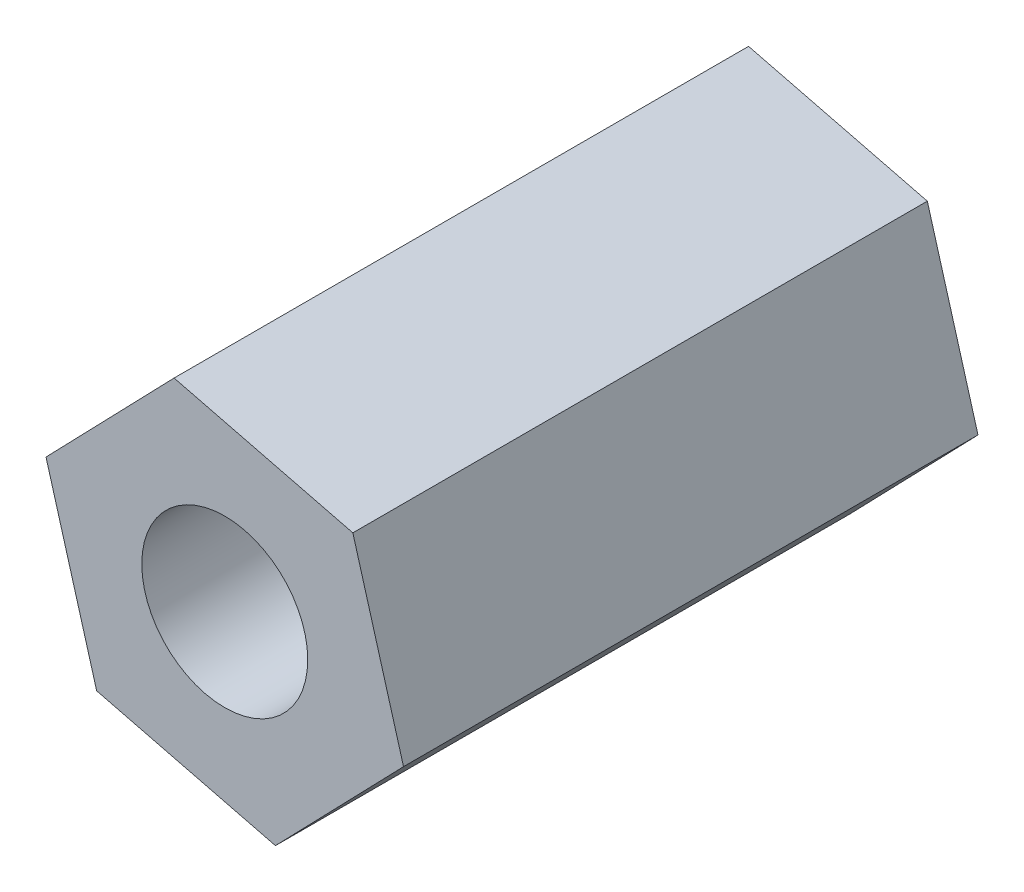
ISO-10303-21;
HEADER;
FILE_DESCRIPTION(('STEP AP214'),'2;1');
FILE_NAME('part.step','',(''),(''),'','','');
FILE_SCHEMA(('AUTOMOTIVE_DESIGN { 1 0 10303 214 1 1 1 1 }'));
ENDSEC;
DATA;
#1=APPLICATION_CONTEXT('core data for automotive mechanical design processes');
#2=APPLICATION_PROTOCOL_DEFINITION('international standard','automotive_design',2000,#1);
#3=PRODUCT_CONTEXT('',#1,'mechanical');
#4=PRODUCT('Part','Part','',(#3));
#5=PRODUCT_RELATED_PRODUCT_CATEGORY('part','',(#4));
#6=PRODUCT_DEFINITION_FORMATION('','',#4);
#7=PRODUCT_DEFINITION_CONTEXT('part definition',#1,'design');
#8=PRODUCT_DEFINITION('design','',#6,#7);
#9=PRODUCT_DEFINITION_SHAPE('','',#8);
#10=(LENGTH_UNIT() NAMED_UNIT(*) SI_UNIT(.MILLI.,.METRE.));
#11=(NAMED_UNIT(*) PLANE_ANGLE_UNIT() SI_UNIT($,.RADIAN.));
#12=(NAMED_UNIT(*) SI_UNIT($,.STERADIAN.) SOLID_ANGLE_UNIT());
#13=UNCERTAINTY_MEASURE_WITH_UNIT(LENGTH_MEASURE(1.E-05),#10,'distance_accuracy_value','');
#14=(GEOMETRIC_REPRESENTATION_CONTEXT(3) GLOBAL_UNCERTAINTY_ASSIGNED_CONTEXT((#13)) GLOBAL_UNIT_ASSIGNED_CONTEXT((#10,
#11,#12)) REPRESENTATION_CONTEXT('',''));
#15=CARTESIAN_POINT('',(0.,0.,0.));
#16=DIRECTION('',(0.,0.,1.));
#17=DIRECTION('',(1.,0.,0.));
#18=AXIS2_PLACEMENT_3D('',#15,#16,#17);
#19=CARTESIAN_POINT('',(-2.01661019445048,7.04958272928063,22.86));
#20=DIRECTION('',(0.718900237898645,-0.695113262676862,0.));
#21=DIRECTION('',(0.695113262676862,0.718900237898645,0.));
#22=AXIS2_PLACEMENT_3D('',#19,#20,#21);
#23=PLANE('',#22);
#24=DIRECTION('',(-0.695113262676862,-0.718900237898645,0.));
#25=VECTOR('',#24,1.);
#26=CARTESIAN_POINT('',(-2.01661019445048,7.04958272928063,0.));
#27=LINE('',#26,#25);
#28=CARTESIAN_POINT('',(-2.01661019445048,7.04958272928063,0.));
#29=VERTEX_POINT('',#28);
#30=CARTESIAN_POINT('',(-7.1134228268623,1.77835570671552,0.));
#31=VERTEX_POINT('',#30);
#32=EDGE_CURVE('E128',#29,#31,#27,.T.);
#33=ORIENTED_EDGE('',*,*,#32,.T.);
#34=DIRECTION('',(0.,0.,-1.));
#35=VECTOR('',#34,1.);
#36=CARTESIAN_POINT('',(-7.1134228268623,1.77835570671552,22.86));
#37=LINE('',#36,#35);
#38=CARTESIAN_POINT('',(-7.1134228268623,1.77835570671552,22.86));
#39=VERTEX_POINT('',#38);
#40=EDGE_CURVE('E11',#39,#31,#37,.T.);
#41=ORIENTED_EDGE('',*,*,#40,.F.);
#42=DIRECTION('',(-0.695113262676862,-0.718900237898645,0.));
#43=VECTOR('',#42,1.);
#44=CARTESIAN_POINT('',(-2.01661019445048,7.04958272928063,22.86));
#45=LINE('',#44,#43);
#46=CARTESIAN_POINT('',(-2.01661019445048,7.04958272928063,22.86));
#47=VERTEX_POINT('',#46);
#48=EDGE_CURVE('E145',#47,#39,#45,.T.);
#49=ORIENTED_EDGE('',*,*,#48,.F.);
#50=DIRECTION('',(0.,0.,-1.));
#51=VECTOR('',#50,1.);
#52=CARTESIAN_POINT('',(-2.01661019445048,7.04958272928063,22.86));
#53=LINE('',#52,#51);
#54=EDGE_CURVE('E124',#47,#29,#53,.T.);
#55=ORIENTED_EDGE('',*,*,#54,.T.);
#56=EDGE_LOOP('',(#33,#41,#49,#55));
#57=FACE_BOUND('',#56,.T.);
#58=ADVANCED_FACE('F39',(#57),#23,.F.);
#59=CARTESIAN_POINT('',(-7.1134228268623,1.77835570671552,22.86));
#60=DIRECTION('',(0.96143586293497,0.275029237468472,0.));
#61=DIRECTION('',(-0.275029237468472,0.96143586293497,0.));
#62=AXIS2_PLACEMENT_3D('',#59,#60,#61);
#63=PLANE('',#62);
#64=DIRECTION('',(0.275029237468472,-0.96143586293497,0.));
#65=VECTOR('',#64,1.);
#66=CARTESIAN_POINT('',(-7.1134228268623,1.77835570671552,0.));
#67=LINE('',#66,#65);
#68=CARTESIAN_POINT('',(-5.09681263241182,-5.27122702256511,0.));
#69=VERTEX_POINT('',#68);
#70=EDGE_CURVE('E132',#31,#69,#67,.T.);
#71=ORIENTED_EDGE('',*,*,#70,.T.);
#72=DIRECTION('',(0.,0.,-1.));
#73=VECTOR('',#72,1.);
#74=CARTESIAN_POINT('',(-5.09681263241182,-5.27122702256511,22.86));
#75=LINE('',#74,#73);
#76=CARTESIAN_POINT('',(-5.09681263241182,-5.27122702256511,22.86));
#77=VERTEX_POINT('',#76);
#78=EDGE_CURVE('E48',#77,#69,#75,.T.);
#79=ORIENTED_EDGE('',*,*,#78,.F.);
#80=DIRECTION('',(0.275029237468472,-0.96143586293497,0.));
#81=VECTOR('',#80,1.);
#82=CARTESIAN_POINT('',(-7.1134228268623,1.77835570671552,22.86));
#83=LINE('',#82,#81);
#84=EDGE_CURVE('E93',#39,#77,#83,.T.);
#85=ORIENTED_EDGE('',*,*,#84,.F.);
#86=ORIENTED_EDGE('',*,*,#40,.T.);
#87=EDGE_LOOP('',(#71,#79,#85,#86));
#88=FACE_BOUND('',#87,.T.);
#89=ADVANCED_FACE('F174',(#88),#63,.F.);
#90=CARTESIAN_POINT('',(-5.09681263241182,-5.27122702256511,22.86));
#91=DIRECTION('',(0.242535625036325,0.970142500145334,0.));
#92=DIRECTION('',(-0.970142500145334,0.242535625036325,0.));
#93=AXIS2_PLACEMENT_3D('',#90,#91,#92);
#94=PLANE('',#93);
#95=DIRECTION('',(0.970142500145334,-0.242535625036325,0.));
#96=VECTOR('',#95,1.);
#97=CARTESIAN_POINT('',(-5.09681263241182,-5.27122702256511,0.));
#98=LINE('',#97,#96);
#99=CARTESIAN_POINT('',(2.01661019445049,-7.04958272928063,0.));
#100=VERTEX_POINT('',#99);
#101=EDGE_CURVE('E136',#69,#100,#98,.T.);
#102=ORIENTED_EDGE('',*,*,#101,.T.);
#103=DIRECTION('',(0.,0.,-1.));
#104=VECTOR('',#103,1.);
#105=CARTESIAN_POINT('',(2.01661019445049,-7.04958272928063,22.86));
#106=LINE('',#105,#104);
#107=CARTESIAN_POINT('',(2.01661019445049,-7.04958272928063,22.86));
#108=VERTEX_POINT('',#107);
#109=EDGE_CURVE('E117',#108,#100,#106,.T.);
#110=ORIENTED_EDGE('',*,*,#109,.F.);
#111=DIRECTION('',(0.970142500145334,-0.242535625036325,0.));
#112=VECTOR('',#111,1.);
#113=CARTESIAN_POINT('',(-5.09681263241182,-5.27122702256511,22.86));
#114=LINE('',#113,#112);
#115=EDGE_CURVE('E106',#77,#108,#114,.T.);
#116=ORIENTED_EDGE('',*,*,#115,.F.);
#117=ORIENTED_EDGE('',*,*,#78,.T.);
#118=EDGE_LOOP('',(#102,#110,#116,#117));
#119=FACE_BOUND('',#118,.T.);
#120=ADVANCED_FACE('F155',(#119),#94,.F.);
#121=CARTESIAN_POINT('',(2.01661019445049,-7.04958272928063,22.86));
#122=DIRECTION('',(-0.718900237898645,0.695113262676862,0.));
#123=DIRECTION('',(-0.695113262676862,-0.718900237898645,0.));
#124=AXIS2_PLACEMENT_3D('',#121,#122,#123);
#125=PLANE('',#124);
#126=DIRECTION('',(0.695113262676862,0.718900237898645,0.));
#127=VECTOR('',#126,1.);
#128=CARTESIAN_POINT('',(2.01661019445049,-7.04958272928063,0.));
#129=LINE('',#128,#127);
#130=CARTESIAN_POINT('',(7.1134228268623,-1.77835570671552,0.));
#131=VERTEX_POINT('',#130);
#132=EDGE_CURVE('E115',#100,#131,#129,.T.);
#133=ORIENTED_EDGE('',*,*,#132,.T.);
#134=DIRECTION('',(0.,0.,-1.));
#135=VECTOR('',#134,1.);
#136=CARTESIAN_POINT('',(7.1134228268623,-1.77835570671552,22.86));
#137=LINE('',#136,#135);
#138=CARTESIAN_POINT('',(7.1134228268623,-1.77835570671552,22.86));
#139=VERTEX_POINT('',#138);
#140=EDGE_CURVE('E112',#139,#131,#137,.T.);
#141=ORIENTED_EDGE('',*,*,#140,.F.);
#142=DIRECTION('',(0.695113262676862,0.718900237898645,0.));
#143=VECTOR('',#142,1.);
#144=CARTESIAN_POINT('',(2.01661019445049,-7.04958272928063,22.86));
#145=LINE('',#144,#143);
#146=EDGE_CURVE('E100',#108,#139,#145,.T.);
#147=ORIENTED_EDGE('',*,*,#146,.F.);
#148=ORIENTED_EDGE('',*,*,#109,.T.);
#149=EDGE_LOOP('',(#133,#141,#147,#148));
#150=FACE_BOUND('',#149,.T.);
#151=ADVANCED_FACE('F113',(#150),#125,.F.);
#152=CARTESIAN_POINT('',(7.1134228268623,-1.77835570671552,22.86));
#153=DIRECTION('',(-0.96143586293497,-0.275029237468472,0.));
#154=DIRECTION('',(0.275029237468472,-0.96143586293497,0.));
#155=AXIS2_PLACEMENT_3D('',#152,#153,#154);
#156=PLANE('',#155);
#157=DIRECTION('',(-0.275029237468472,0.96143586293497,0.));
#158=VECTOR('',#157,1.);
#159=CARTESIAN_POINT('',(7.1134228268623,-1.77835570671552,0.));
#160=LINE('',#159,#158);
#161=CARTESIAN_POINT('',(5.09681263241182,5.27122702256512,0.));
#162=VERTEX_POINT('',#161);
#163=EDGE_CURVE('E79',#131,#162,#160,.T.);
#164=ORIENTED_EDGE('',*,*,#163,.T.);
#165=DIRECTION('',(0.,0.,-1.));
#166=VECTOR('',#165,1.);
#167=CARTESIAN_POINT('',(5.09681263241182,5.27122702256512,22.86));
#168=LINE('',#167,#166);
#169=CARTESIAN_POINT('',(5.09681263241182,5.27122702256512,22.86));
#170=VERTEX_POINT('',#169);
#171=EDGE_CURVE('E118',#170,#162,#168,.T.);
#172=ORIENTED_EDGE('',*,*,#171,.F.);
#173=DIRECTION('',(-0.275029237468472,0.96143586293497,0.));
#174=VECTOR('',#173,1.);
#175=CARTESIAN_POINT('',(7.1134228268623,-1.77835570671552,22.86));
#176=LINE('',#175,#174);
#177=EDGE_CURVE('E104',#139,#170,#176,.T.);
#178=ORIENTED_EDGE('',*,*,#177,.F.);
#179=ORIENTED_EDGE('',*,*,#140,.T.);
#180=EDGE_LOOP('',(#164,#172,#178,#179));
#181=FACE_BOUND('',#180,.T.);
#182=ADVANCED_FACE('F120',(#181),#156,.F.);
#183=CARTESIAN_POINT('',(5.09681263241182,5.27122702256512,22.86));
#184=DIRECTION('',(-0.242535625036325,-0.970142500145334,0.));
#185=DIRECTION('',(0.970142500145334,-0.242535625036325,0.));
#186=AXIS2_PLACEMENT_3D('',#183,#184,#185);
#187=PLANE('',#186);
#188=DIRECTION('',(-0.970142500145334,0.242535625036325,0.));
#189=VECTOR('',#188,1.);
#190=CARTESIAN_POINT('',(5.09681263241182,5.27122702256512,0.));
#191=LINE('',#190,#189);
#192=EDGE_CURVE('E85',#162,#29,#191,.T.);
#193=ORIENTED_EDGE('',*,*,#192,.T.);
#194=ORIENTED_EDGE('',*,*,#54,.F.);
#195=DIRECTION('',(-0.970142500145334,0.242535625036325,0.));
#196=VECTOR('',#195,1.);
#197=CARTESIAN_POINT('',(5.09681263241182,5.27122702256512,22.86));
#198=LINE('',#197,#196);
#199=EDGE_CURVE('E56',#170,#47,#198,.T.);
#200=ORIENTED_EDGE('',*,*,#199,.F.);
#201=ORIENTED_EDGE('',*,*,#171,.T.);
#202=EDGE_LOOP('',(#193,#194,#200,#201));
#203=FACE_BOUND('',#202,.T.);
#204=ADVANCED_FACE('F162',(#203),#187,.F.);
#205=CARTESIAN_POINT('',(0.,0.,22.86));
#206=DIRECTION('',(0.,0.,1.));
#207=DIRECTION('',(1.,0.,0.));
#208=AXIS2_PLACEMENT_3D('',#205,#206,#207);
#209=PLANE('',#208);
#210=CARTESIAN_POINT('',(0.,0.,22.86));
#211=DIRECTION('',(0.,0.,1.));
#212=DIRECTION('',(1.,0.,0.));
#213=AXIS2_PLACEMENT_3D('',#210,#211,#212);
#214=CIRCLE('',#213,3.302);
#215=CARTESIAN_POINT('',(3.302,0.,22.86));
#216=VERTEX_POINT('',#215);
#217=EDGE_CURVE('E133',#216,#216,#214,.T.);
#218=ORIENTED_EDGE('',*,*,#217,.F.);
#219=EDGE_LOOP('',(#218));
#220=FACE_BOUND('',#219,.T.);
#221=ORIENTED_EDGE('',*,*,#48,.T.);
#222=ORIENTED_EDGE('',*,*,#84,.T.);
#223=ORIENTED_EDGE('',*,*,#115,.T.);
#224=ORIENTED_EDGE('',*,*,#146,.T.);
#225=ORIENTED_EDGE('',*,*,#177,.T.);
#226=ORIENTED_EDGE('',*,*,#199,.T.);
#227=EDGE_LOOP('',(#221,#222,#223,#224,#225,#226));
#228=FACE_BOUND('',#227,.T.);
#229=ADVANCED_FACE('F102',(#220,#228),#209,.T.);
#230=CARTESIAN_POINT('',(0.,0.,0.));
#231=DIRECTION('',(0.,0.,1.));
#232=DIRECTION('',(1.,0.,0.));
#233=AXIS2_PLACEMENT_3D('',#230,#231,#232);
#234=PLANE('',#233);
#235=CARTESIAN_POINT('',(0.,0.,0.));
#236=DIRECTION('',(0.,0.,-1.));
#237=DIRECTION('',(-1.,0.,0.));
#238=AXIS2_PLACEMENT_3D('',#235,#236,#237);
#239=CIRCLE('',#238,3.302);
#240=CARTESIAN_POINT('',(-3.302,0.,0.));
#241=VERTEX_POINT('',#240);
#242=EDGE_CURVE('E229',#241,#241,#239,.T.);
#243=ORIENTED_EDGE('',*,*,#242,.F.);
#244=EDGE_LOOP('',(#243));
#245=FACE_BOUND('',#244,.T.);
#246=ORIENTED_EDGE('',*,*,#32,.F.);
#247=ORIENTED_EDGE('',*,*,#192,.F.);
#248=ORIENTED_EDGE('',*,*,#163,.F.);
#249=ORIENTED_EDGE('',*,*,#132,.F.);
#250=ORIENTED_EDGE('',*,*,#101,.F.);
#251=ORIENTED_EDGE('',*,*,#70,.F.);
#252=EDGE_LOOP('',(#246,#247,#248,#249,#250,#251));
#253=FACE_BOUND('',#252,.T.);
#254=ADVANCED_FACE('F158',(#245,#253),#234,.F.);
#255=CARTESIAN_POINT('',(0.,0.,39.878));
#256=DIRECTION('',(0.,0.,-1.));
#257=DIRECTION('',(-1.,0.,0.));
#258=AXIS2_PLACEMENT_3D('',#255,#256,#257);
#259=CYLINDRICAL_SURFACE('',#258,3.302);
#260=ORIENTED_EDGE('',*,*,#217,.T.);
#261=EDGE_LOOP('',(#260));
#262=FACE_BOUND('',#261,.T.);
#263=ORIENTED_EDGE('',*,*,#242,.T.);
#264=EDGE_LOOP('',(#263));
#265=FACE_BOUND('',#264,.T.);
#266=ADVANCED_FACE('F211',(#262,#265),#259,.F.);
#267=CLOSED_SHELL('',(#58,#89,#120,#151,#182,#204,#229,#254,#266));
#268=MANIFOLD_SOLID_BREP('B2',#267);
#269=ADVANCED_BREP_SHAPE_REPRESENTATION('',(#18,#268),#14);
#270=SHAPE_DEFINITION_REPRESENTATION(#9,#269);
ENDSEC;
END-ISO-10303-21;
